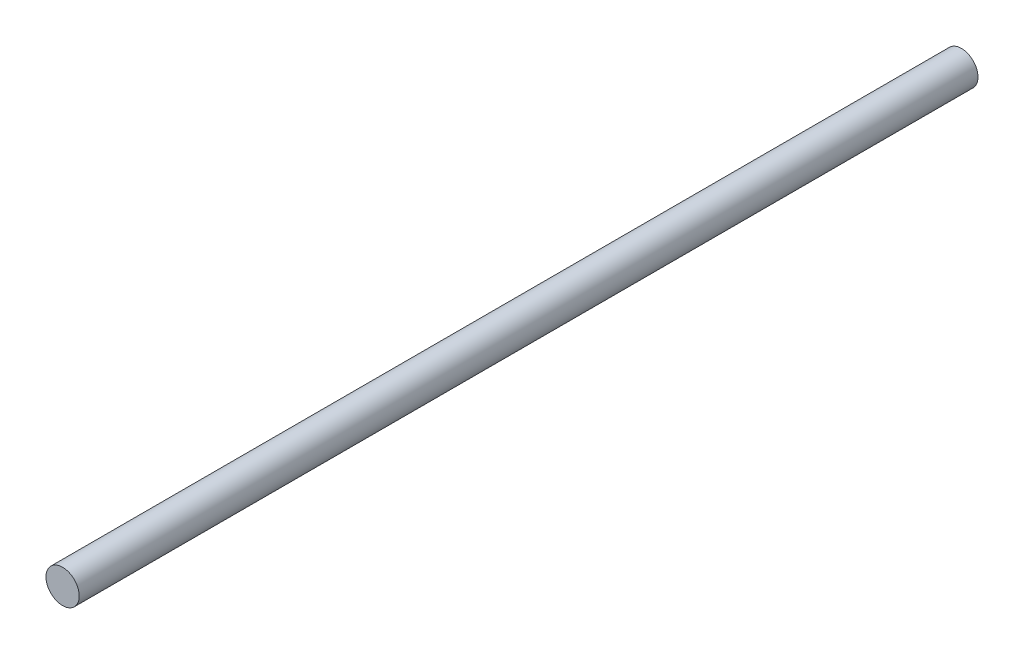
ISO-10303-21;
HEADER;
FILE_DESCRIPTION(('STEP AP214'),'2;1');
FILE_NAME('part.step','',(''),(''),'','','');
FILE_SCHEMA(('AUTOMOTIVE_DESIGN { 1 0 10303 214 1 1 1 1 }'));
ENDSEC;
DATA;
#1=APPLICATION_CONTEXT('core data for automotive mechanical design processes');
#2=APPLICATION_PROTOCOL_DEFINITION('international standard','automotive_design',2000,#1);
#3=PRODUCT_CONTEXT('',#1,'mechanical');
#4=PRODUCT('Part','Part','',(#3));
#5=PRODUCT_RELATED_PRODUCT_CATEGORY('part','',(#4));
#6=PRODUCT_DEFINITION_FORMATION('','',#4);
#7=PRODUCT_DEFINITION_CONTEXT('part definition',#1,'design');
#8=PRODUCT_DEFINITION('design','',#6,#7);
#9=PRODUCT_DEFINITION_SHAPE('','',#8);
#10=(LENGTH_UNIT() NAMED_UNIT(*) SI_UNIT(.MILLI.,.METRE.));
#11=(NAMED_UNIT(*) PLANE_ANGLE_UNIT() SI_UNIT($,.RADIAN.));
#12=(NAMED_UNIT(*) SI_UNIT($,.STERADIAN.) SOLID_ANGLE_UNIT());
#13=UNCERTAINTY_MEASURE_WITH_UNIT(LENGTH_MEASURE(1.E-05),#10,'distance_accuracy_value','');
#14=(GEOMETRIC_REPRESENTATION_CONTEXT(3) GLOBAL_UNCERTAINTY_ASSIGNED_CONTEXT((#13)) GLOBAL_UNIT_ASSIGNED_CONTEXT((#10,
#11,#12)) REPRESENTATION_CONTEXT('',''));
#15=CARTESIAN_POINT('',(0.,0.,0.));
#16=DIRECTION('',(0.,0.,1.));
#17=DIRECTION('',(1.,0.,0.));
#18=AXIS2_PLACEMENT_3D('',#15,#16,#17);
#19=CARTESIAN_POINT('',(0.,0.,108.115));
#20=DIRECTION('',(0.,0.,-1.));
#21=DIRECTION('',(-1.,0.,0.));
#22=AXIS2_PLACEMENT_3D('',#19,#20,#21);
#23=CYLINDRICAL_SURFACE('',#22,4.);
#24=CARTESIAN_POINT('',(0.,0.,108.115));
#25=DIRECTION('',(0.,0.,1.));
#26=DIRECTION('',(1.,0.,0.));
#27=AXIS2_PLACEMENT_3D('',#24,#25,#26);
#28=CIRCLE('',#27,4.);
#29=CARTESIAN_POINT('',(4.,0.,108.115));
#30=VERTEX_POINT('',#29);
#31=EDGE_CURVE('E10',#30,#30,#28,.T.);
#32=ORIENTED_EDGE('',*,*,#31,.F.);
#33=EDGE_LOOP('',(#32));
#34=FACE_BOUND('',#33,.T.);
#35=CARTESIAN_POINT('',(0.,0.,-108.115));
#36=DIRECTION('',(0.,0.,1.));
#37=DIRECTION('',(1.,0.,0.));
#38=AXIS2_PLACEMENT_3D('',#35,#36,#37);
#39=CIRCLE('',#38,4.);
#40=CARTESIAN_POINT('',(4.,0.,-108.115));
#41=VERTEX_POINT('',#40);
#42=EDGE_CURVE('E42',#41,#41,#39,.T.);
#43=ORIENTED_EDGE('',*,*,#42,.T.);
#44=EDGE_LOOP('',(#43));
#45=FACE_BOUND('',#44,.T.);
#46=ADVANCED_FACE('F39',(#34,#45),#23,.T.);
#47=CARTESIAN_POINT('',(0.,0.,108.115));
#48=DIRECTION('',(0.,0.,1.));
#49=DIRECTION('',(1.,0.,0.));
#50=AXIS2_PLACEMENT_3D('',#47,#48,#49);
#51=PLANE('',#50);
#52=ORIENTED_EDGE('',*,*,#31,.T.);
#53=EDGE_LOOP('',(#52));
#54=FACE_BOUND('',#53,.T.);
#55=ADVANCED_FACE('F56',(#54),#51,.T.);
#56=CARTESIAN_POINT('',(0.,0.,-108.115));
#57=DIRECTION('',(0.,0.,1.));
#58=DIRECTION('',(1.,0.,0.));
#59=AXIS2_PLACEMENT_3D('',#56,#57,#58);
#60=PLANE('',#59);
#61=ORIENTED_EDGE('',*,*,#42,.F.);
#62=EDGE_LOOP('',(#61));
#63=FACE_BOUND('',#62,.T.);
#64=ADVANCED_FACE('F54',(#63),#60,.F.);
#65=CLOSED_SHELL('',(#46,#55,#64));
#66=MANIFOLD_SOLID_BREP('B2',#65);
#67=ADVANCED_BREP_SHAPE_REPRESENTATION('',(#18,#66),#14);
#68=SHAPE_DEFINITION_REPRESENTATION(#9,#67);
ENDSEC;
END-ISO-10303-21;
